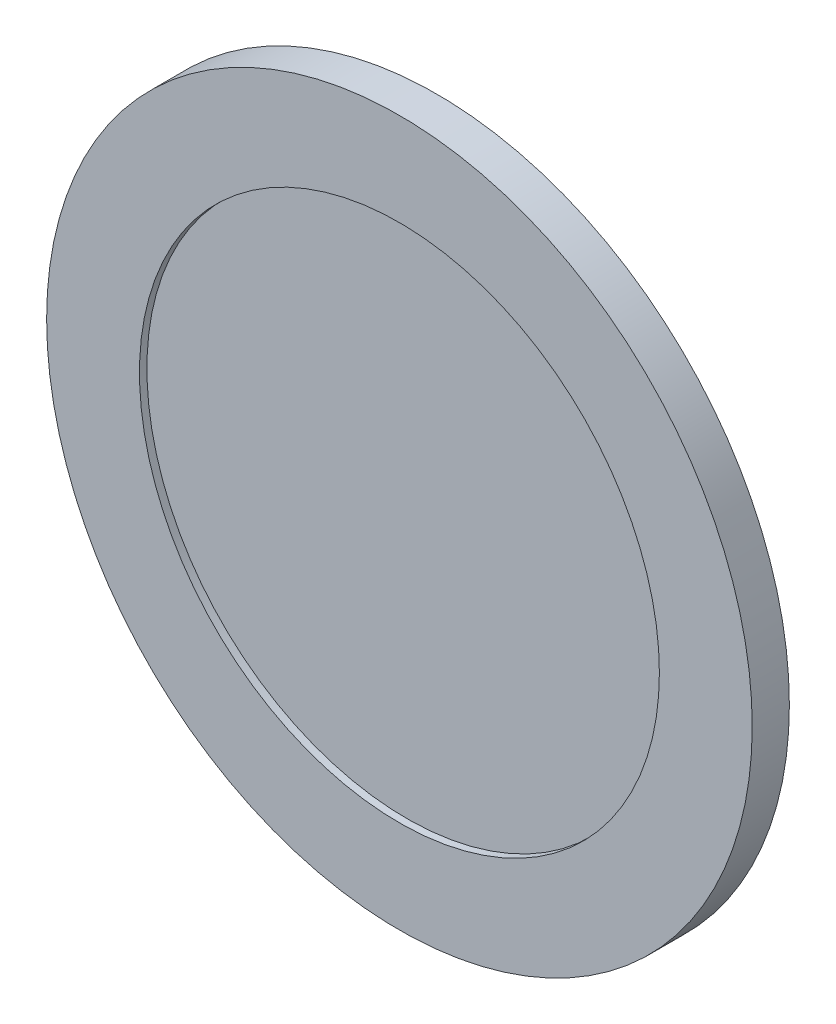
ISO-10303-21;
HEADER;
FILE_DESCRIPTION(('STEP AP214'),'2;1');
FILE_NAME('part.step','',(''),(''),'','','');
FILE_SCHEMA(('AUTOMOTIVE_DESIGN { 1 0 10303 214 1 1 1 1 }'));
ENDSEC;
DATA;
#1=APPLICATION_CONTEXT('core data for automotive mechanical design processes');
#2=APPLICATION_PROTOCOL_DEFINITION('international standard','automotive_design',2000,#1);
#3=PRODUCT_CONTEXT('',#1,'mechanical');
#4=PRODUCT('Part','Part','',(#3));
#5=PRODUCT_RELATED_PRODUCT_CATEGORY('part','',(#4));
#6=PRODUCT_DEFINITION_FORMATION('','',#4);
#7=PRODUCT_DEFINITION_CONTEXT('part definition',#1,'design');
#8=PRODUCT_DEFINITION('design','',#6,#7);
#9=PRODUCT_DEFINITION_SHAPE('','',#8);
#10=(LENGTH_UNIT() NAMED_UNIT(*) SI_UNIT(.MILLI.,.METRE.));
#11=(NAMED_UNIT(*) PLANE_ANGLE_UNIT() SI_UNIT($,.RADIAN.));
#12=(NAMED_UNIT(*) SI_UNIT($,.STERADIAN.) SOLID_ANGLE_UNIT());
#13=UNCERTAINTY_MEASURE_WITH_UNIT(LENGTH_MEASURE(1.E-05),#10,'distance_accuracy_value','');
#14=(GEOMETRIC_REPRESENTATION_CONTEXT(3) GLOBAL_UNCERTAINTY_ASSIGNED_CONTEXT((#13)) GLOBAL_UNIT_ASSIGNED_CONTEXT((#10,
#11,#12)) REPRESENTATION_CONTEXT('',''));
#15=CARTESIAN_POINT('',(0.,0.,0.));
#16=DIRECTION('',(0.,0.,1.));
#17=DIRECTION('',(1.,0.,0.));
#18=AXIS2_PLACEMENT_3D('',#15,#16,#17);
#19=CARTESIAN_POINT('',(0.,0.,1.));
#20=DIRECTION('',(0.,0.,-1.));
#21=DIRECTION('',(-1.,0.,0.));
#22=AXIS2_PLACEMENT_3D('',#19,#20,#21);
#23=CYLINDRICAL_SURFACE('',#22,9.5);
#24=CARTESIAN_POINT('',(0.,0.,1.));
#25=DIRECTION('',(0.,0.,1.));
#26=DIRECTION('',(1.,0.,0.));
#27=AXIS2_PLACEMENT_3D('',#24,#25,#26);
#28=CIRCLE('',#27,9.5);
#29=CARTESIAN_POINT('',(9.5,0.,1.));
#30=VERTEX_POINT('',#29);
#31=EDGE_CURVE('E10',#30,#30,#28,.T.);
#32=ORIENTED_EDGE('',*,*,#31,.F.);
#33=EDGE_LOOP('',(#32));
#34=FACE_BOUND('',#33,.T.);
#35=CARTESIAN_POINT('',(0.,0.,0.));
#36=DIRECTION('',(0.,0.,1.));
#37=DIRECTION('',(1.,0.,0.));
#38=AXIS2_PLACEMENT_3D('',#35,#36,#37);
#39=CIRCLE('',#38,9.5);
#40=CARTESIAN_POINT('',(9.5,0.,0.));
#41=VERTEX_POINT('',#40);
#42=EDGE_CURVE('E40',#41,#41,#39,.T.);
#43=ORIENTED_EDGE('',*,*,#42,.T.);
#44=EDGE_LOOP('',(#43));
#45=FACE_BOUND('',#44,.T.);
#46=ADVANCED_FACE('F37',(#34,#45),#23,.T.);
#47=CARTESIAN_POINT('',(0.,0.,1.));
#48=DIRECTION('',(0.,0.,1.));
#49=DIRECTION('',(1.,0.,0.));
#50=AXIS2_PLACEMENT_3D('',#47,#48,#49);
#51=PLANE('',#50);
#52=CARTESIAN_POINT('',(0.,0.,1.));
#53=DIRECTION('',(0.,0.,1.));
#54=DIRECTION('',(1.,0.,0.));
#55=AXIS2_PLACEMENT_3D('',#52,#53,#54);
#56=CIRCLE('',#55,7.);
#57=CARTESIAN_POINT('',(7.,0.,1.));
#58=VERTEX_POINT('',#57);
#59=EDGE_CURVE('E49',#58,#58,#56,.T.);
#60=ORIENTED_EDGE('',*,*,#59,.F.);
#61=EDGE_LOOP('',(#60));
#62=FACE_BOUND('',#61,.T.);
#63=ORIENTED_EDGE('',*,*,#31,.T.);
#64=EDGE_LOOP('',(#63));
#65=FACE_BOUND('',#64,.T.);
#66=ADVANCED_FACE('F64',(#62,#65),#51,.T.);
#67=CARTESIAN_POINT('',(0.,0.,0.));
#68=DIRECTION('',(0.,0.,1.));
#69=DIRECTION('',(1.,0.,0.));
#70=AXIS2_PLACEMENT_3D('',#67,#68,#69);
#71=PLANE('',#70);
#72=ORIENTED_EDGE('',*,*,#42,.F.);
#73=EDGE_LOOP('',(#72));
#74=FACE_BOUND('',#73,.T.);
#75=ADVANCED_FACE('F60',(#74),#71,.F.);
#76=CARTESIAN_POINT('',(0.,0.,0.8));
#77=DIRECTION('',(0.,0.,1.));
#78=DIRECTION('',(1.,0.,0.));
#79=AXIS2_PLACEMENT_3D('',#76,#77,#78);
#80=CYLINDRICAL_SURFACE('',#79,7.);
#81=CARTESIAN_POINT('',(0.,0.,0.8));
#82=DIRECTION('',(0.,0.,1.));
#83=DIRECTION('',(1.,0.,0.));
#84=AXIS2_PLACEMENT_3D('',#81,#82,#83);
#85=CIRCLE('',#84,7.);
#86=CARTESIAN_POINT('',(7.,0.,0.8));
#87=VERTEX_POINT('',#86);
#88=EDGE_CURVE('E47',#87,#87,#85,.T.);
#89=ORIENTED_EDGE('',*,*,#88,.F.);
#90=EDGE_LOOP('',(#89));
#91=FACE_BOUND('',#90,.T.);
#92=ORIENTED_EDGE('',*,*,#59,.T.);
#93=EDGE_LOOP('',(#92));
#94=FACE_BOUND('',#93,.T.);
#95=ADVANCED_FACE('F57',(#91,#94),#80,.F.);
#96=CARTESIAN_POINT('',(0.,0.,0.8));
#97=DIRECTION('',(0.,0.,1.));
#98=DIRECTION('',(1.,0.,0.));
#99=AXIS2_PLACEMENT_3D('',#96,#97,#98);
#100=PLANE('',#99);
#101=ORIENTED_EDGE('',*,*,#88,.T.);
#102=EDGE_LOOP('',(#101));
#103=FACE_BOUND('',#102,.T.);
#104=ADVANCED_FACE('F55',(#103),#100,.T.);
#105=CLOSED_SHELL('',(#46,#66,#75,#95,#104));
#106=MANIFOLD_SOLID_BREP('B2',#105);
#107=ADVANCED_BREP_SHAPE_REPRESENTATION('',(#18,#106),#14);
#108=SHAPE_DEFINITION_REPRESENTATION(#9,#107);
ENDSEC;
END-ISO-10303-21;
